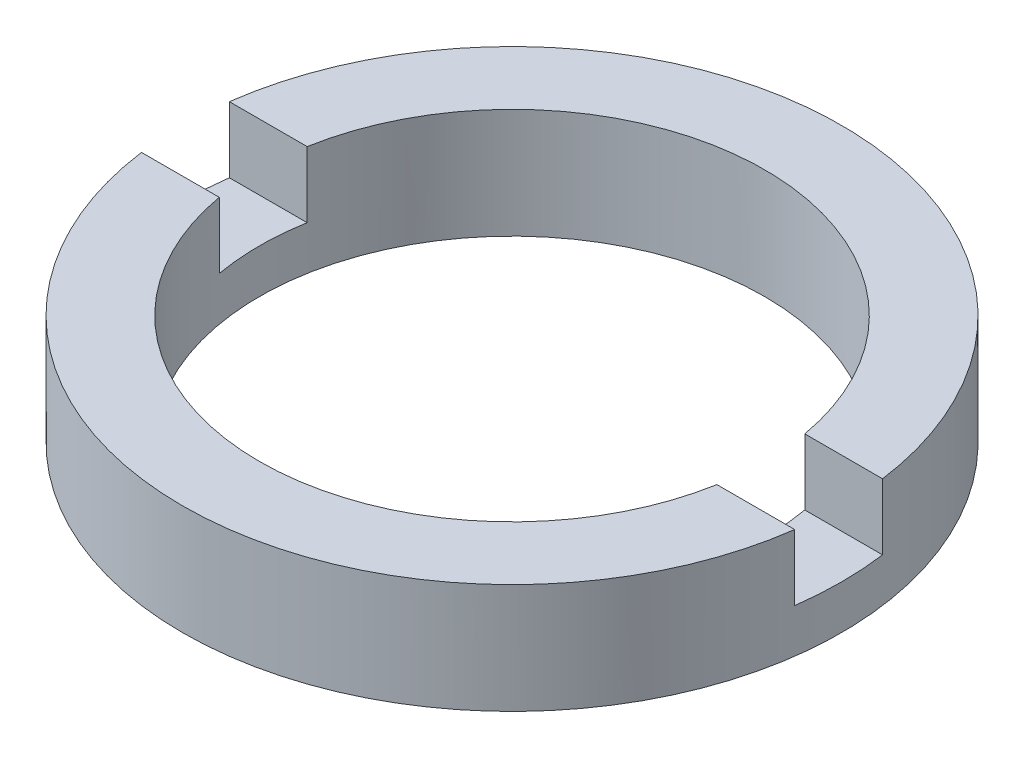
ISO-10303-21;
HEADER;
FILE_DESCRIPTION(('STEP AP214'),'2;1');
FILE_NAME('part.step','',(''),(''),'','','');
FILE_SCHEMA(('AUTOMOTIVE_DESIGN { 1 0 10303 214 1 1 1 1 }'));
ENDSEC;
DATA;
#1=APPLICATION_CONTEXT('core data for automotive mechanical design processes');
#2=APPLICATION_PROTOCOL_DEFINITION('international standard','automotive_design',2000,#1);
#3=PRODUCT_CONTEXT('',#1,'mechanical');
#4=PRODUCT('Part','Part','',(#3));
#5=PRODUCT_RELATED_PRODUCT_CATEGORY('part','',(#4));
#6=PRODUCT_DEFINITION_FORMATION('','',#4);
#7=PRODUCT_DEFINITION_CONTEXT('part definition',#1,'design');
#8=PRODUCT_DEFINITION('design','',#6,#7);
#9=PRODUCT_DEFINITION_SHAPE('','',#8);
#10=(LENGTH_UNIT() NAMED_UNIT(*) SI_UNIT(.MILLI.,.METRE.));
#11=(NAMED_UNIT(*) PLANE_ANGLE_UNIT() SI_UNIT($,.RADIAN.));
#12=(NAMED_UNIT(*) SI_UNIT($,.STERADIAN.) SOLID_ANGLE_UNIT());
#13=UNCERTAINTY_MEASURE_WITH_UNIT(LENGTH_MEASURE(1.E-05),#10,'distance_accuracy_value','');
#14=(GEOMETRIC_REPRESENTATION_CONTEXT(3) GLOBAL_UNCERTAINTY_ASSIGNED_CONTEXT((#13)) GLOBAL_UNIT_ASSIGNED_CONTEXT((#10,
#11,#12)) REPRESENTATION_CONTEXT('',''));
#15=CARTESIAN_POINT('',(0.,0.,0.));
#16=DIRECTION('',(0.,0.,1.));
#17=DIRECTION('',(1.,0.,0.));
#18=AXIS2_PLACEMENT_3D('',#15,#16,#17);
#19=CARTESIAN_POINT('',(5.75000000000001,-1.96424978717943,0.));
#20=DIRECTION('',(0.,-1.,0.));
#21=DIRECTION('',(0.,0.,-1.));
#22=AXIS2_PLACEMENT_3D('',#19,#20,#21);
#23=PLANE('',#22);
#24=CARTESIAN_POINT('',(0.,-1.96424978717943,0.));
#25=DIRECTION('',(0.,1.,0.));
#26=DIRECTION('',(0.,0.,1.));
#27=AXIS2_PLACEMENT_3D('',#24,#25,#26);
#28=CIRCLE('',#27,7.50000000000001);
#29=CARTESIAN_POINT('',(-7.43303437365927,-1.96424978717943,1.));
#30=VERTEX_POINT('',#29);
#31=CARTESIAN_POINT('',(7.43303437365925,-1.96424978717943,1.));
#32=VERTEX_POINT('',#31);
#33=EDGE_CURVE('E127',#30,#32,#28,.T.);
#34=ORIENTED_EDGE('',*,*,#33,.T.);
#35=DIRECTION('',(1.,0.,0.));
#36=VECTOR('',#35,1.);
#37=CARTESIAN_POINT('',(-26.8525402726146,-1.96424978717943,1.));
#38=LINE('',#37,#36);
#39=CARTESIAN_POINT('',(5.66237582645307,-1.96424978717943,1.));
#40=VERTEX_POINT('',#39);
#41=EDGE_CURVE('E120',#40,#32,#38,.T.);
#42=ORIENTED_EDGE('',*,*,#41,.F.);
#43=CARTESIAN_POINT('',(0.,-1.96424978717943,0.));
#44=DIRECTION('',(0.,1.,0.));
#45=DIRECTION('',(0.,0.,1.));
#46=AXIS2_PLACEMENT_3D('',#43,#44,#45);
#47=CIRCLE('',#46,5.75000000000001);
#48=CARTESIAN_POINT('',(-5.66237582645307,-1.96424978717943,1.));
#49=VERTEX_POINT('',#48);
#50=EDGE_CURVE('E134',#49,#40,#47,.T.);
#51=ORIENTED_EDGE('',*,*,#50,.F.);
#52=EDGE_CURVE('E149',#30,#49,#38,.T.);
#53=ORIENTED_EDGE('',*,*,#52,.F.);
#54=EDGE_LOOP('',(#34,#42,#51,#53));
#55=FACE_BOUND('',#54,.T.);
#56=ADVANCED_FACE('F37',(#55),#23,.F.);
#57=CARTESIAN_POINT('',(0.,56.2608426270136,0.));
#58=DIRECTION('',(0.,1.,0.));
#59=DIRECTION('',(0.,0.,1.));
#60=AXIS2_PLACEMENT_3D('',#57,#58,#59);
#61=CYLINDRICAL_SURFACE('',#60,7.50000000000001);
#62=CARTESIAN_POINT('',(0.,-3.46424978717943,0.));
#63=DIRECTION('',(0.,1.,0.));
#64=DIRECTION('',(0.,0.,1.));
#65=AXIS2_PLACEMENT_3D('',#62,#63,#64);
#66=CIRCLE('',#65,7.50000000000001);
#67=CARTESIAN_POINT('',(7.43303437365926,-3.46424978717943,1.));
#68=VERTEX_POINT('',#67);
#69=CARTESIAN_POINT('',(7.43303437365926,-3.46424978717943,-1.));
#70=VERTEX_POINT('',#69);
#71=EDGE_CURVE('E110',#68,#70,#66,.T.);
#72=ORIENTED_EDGE('',*,*,#71,.F.);
#73=DIRECTION('',(0.,1.,0.));
#74=VECTOR('',#73,1.);
#75=CARTESIAN_POINT('',(7.43303437365926,56.2608426270136,1.));
#76=LINE('',#75,#74);
#77=EDGE_CURVE('E162',#68,#32,#76,.T.);
#78=ORIENTED_EDGE('',*,*,#77,.T.);
#79=ORIENTED_EDGE('',*,*,#33,.F.);
#80=DIRECTION('',(0.,1.,0.));
#81=VECTOR('',#80,1.);
#82=CARTESIAN_POINT('',(-7.43303437365926,56.2608426270136,1.));
#83=LINE('',#82,#81);
#84=CARTESIAN_POINT('',(-7.43303437365926,-3.46424978717943,1.));
#85=VERTEX_POINT('',#84);
#86=EDGE_CURVE('E159',#30,#85,#83,.F.);
#87=ORIENTED_EDGE('',*,*,#86,.T.);
#88=CARTESIAN_POINT('',(-7.43303437365926,-3.46424978717943,-1.));
#89=VERTEX_POINT('',#88);
#90=EDGE_CURVE('E156',#89,#85,#66,.T.);
#91=ORIENTED_EDGE('',*,*,#90,.F.);
#92=DIRECTION('',(0.,1.,0.));
#93=VECTOR('',#92,1.);
#94=CARTESIAN_POINT('',(-7.43303437365926,56.2608426270136,-1.));
#95=LINE('',#94,#93);
#96=CARTESIAN_POINT('',(-7.43303437365927,-1.96424978717943,-1.));
#97=VERTEX_POINT('',#96);
#98=EDGE_CURVE('E109',#89,#97,#95,.T.);
#99=ORIENTED_EDGE('',*,*,#98,.T.);
#100=CARTESIAN_POINT('',(7.43303437365925,-1.96424978717943,-1.));
#101=VERTEX_POINT('',#100);
#102=EDGE_CURVE('E117',#101,#97,#28,.T.);
#103=ORIENTED_EDGE('',*,*,#102,.F.);
#104=DIRECTION('',(0.,1.,0.));
#105=VECTOR('',#104,1.);
#106=CARTESIAN_POINT('',(7.43303437365926,56.2608426270136,-1.));
#107=LINE('',#106,#105);
#108=EDGE_CURVE('E101',#101,#70,#107,.F.);
#109=ORIENTED_EDGE('',*,*,#108,.T.);
#110=EDGE_LOOP('',(#72,#78,#79,#87,#91,#99,#103,#109));
#111=FACE_BOUND('',#110,.T.);
#112=CARTESIAN_POINT('',(0.,-4.46424978717943,0.));
#113=DIRECTION('',(0.,1.,0.));
#114=DIRECTION('',(0.,0.,1.));
#115=AXIS2_PLACEMENT_3D('',#112,#113,#114);
#116=CIRCLE('',#115,7.50000000000001);
#117=CARTESIAN_POINT('',(0.,-4.46424978717943,7.50000000000001));
#118=VERTEX_POINT('',#117);
#119=EDGE_CURVE('E165',#118,#118,#116,.T.);
#120=ORIENTED_EDGE('',*,*,#119,.T.);
#121=EDGE_LOOP('',(#120));
#122=FACE_BOUND('',#121,.T.);
#123=ADVANCED_FACE('F39',(#111,#122),#61,.T.);
#124=ORIENTED_EDGE('',*,*,#102,.T.);
#125=DIRECTION('',(-1.,0.,0.));
#126=VECTOR('',#125,1.);
#127=CARTESIAN_POINT('',(-26.8525402726146,-1.96424978717943,-1.));
#128=LINE('',#127,#126);
#129=CARTESIAN_POINT('',(-5.66237582645307,-1.96424978717943,-1.));
#130=VERTEX_POINT('',#129);
#131=EDGE_CURVE('E121',#130,#97,#128,.T.);
#132=ORIENTED_EDGE('',*,*,#131,.F.);
#133=CARTESIAN_POINT('',(5.66237582645307,-1.96424978717943,-1.));
#134=VERTEX_POINT('',#133);
#135=EDGE_CURVE('E119',#134,#130,#47,.T.);
#136=ORIENTED_EDGE('',*,*,#135,.F.);
#137=EDGE_CURVE('E104',#101,#134,#128,.T.);
#138=ORIENTED_EDGE('',*,*,#137,.F.);
#139=EDGE_LOOP('',(#124,#132,#136,#138));
#140=FACE_BOUND('',#139,.T.);
#141=ADVANCED_FACE('F115',(#140),#23,.F.);
#142=CARTESIAN_POINT('',(0.,56.2608426270136,0.));
#143=DIRECTION('',(0.,1.,0.));
#144=DIRECTION('',(0.,0.,1.));
#145=AXIS2_PLACEMENT_3D('',#142,#143,#144);
#146=CYLINDRICAL_SURFACE('',#145,5.75000000000001);
#147=CARTESIAN_POINT('',(0.,-3.46424978717943,0.));
#148=DIRECTION('',(0.,1.,0.));
#149=DIRECTION('',(0.,0.,1.));
#150=AXIS2_PLACEMENT_3D('',#147,#148,#149);
#151=CIRCLE('',#150,5.75000000000001);
#152=CARTESIAN_POINT('',(-5.66237582645307,-3.46424978717943,1.));
#153=VERTEX_POINT('',#152);
#154=CARTESIAN_POINT('',(-5.66237582645307,-3.46424978717943,-1.));
#155=VERTEX_POINT('',#154);
#156=EDGE_CURVE('E131',#153,#155,#151,.F.);
#157=ORIENTED_EDGE('',*,*,#156,.F.);
#158=DIRECTION('',(0.,1.,0.));
#159=VECTOR('',#158,1.);
#160=CARTESIAN_POINT('',(-5.66237582645307,56.2608426270136,1.));
#161=LINE('',#160,#159);
#162=EDGE_CURVE('E11',#153,#49,#161,.T.);
#163=ORIENTED_EDGE('',*,*,#162,.T.);
#164=ORIENTED_EDGE('',*,*,#50,.T.);
#165=DIRECTION('',(0.,1.,0.));
#166=VECTOR('',#165,1.);
#167=CARTESIAN_POINT('',(5.66237582645307,56.2608426270136,1.));
#168=LINE('',#167,#166);
#169=CARTESIAN_POINT('',(5.66237582645307,-3.46424978717943,1.));
#170=VERTEX_POINT('',#169);
#171=EDGE_CURVE('E138',#40,#170,#168,.F.);
#172=ORIENTED_EDGE('',*,*,#171,.T.);
#173=CARTESIAN_POINT('',(5.66237582645307,-3.46424978717943,-1.));
#174=VERTEX_POINT('',#173);
#175=EDGE_CURVE('E126',#174,#170,#151,.F.);
#176=ORIENTED_EDGE('',*,*,#175,.F.);
#177=DIRECTION('',(0.,1.,0.));
#178=VECTOR('',#177,1.);
#179=CARTESIAN_POINT('',(5.66237582645307,56.2608426270136,-1.));
#180=LINE('',#179,#178);
#181=EDGE_CURVE('E129',#174,#134,#180,.T.);
#182=ORIENTED_EDGE('',*,*,#181,.T.);
#183=ORIENTED_EDGE('',*,*,#135,.T.);
#184=DIRECTION('',(0.,1.,0.));
#185=VECTOR('',#184,1.);
#186=CARTESIAN_POINT('',(-5.66237582645307,56.2608426270136,-1.));
#187=LINE('',#186,#185);
#188=EDGE_CURVE('E45',#130,#155,#187,.F.);
#189=ORIENTED_EDGE('',*,*,#188,.T.);
#190=EDGE_LOOP('',(#157,#163,#164,#172,#176,#182,#183,#189));
#191=FACE_BOUND('',#190,.T.);
#192=CARTESIAN_POINT('',(0.,-4.46424978717943,0.));
#193=DIRECTION('',(0.,1.,0.));
#194=DIRECTION('',(0.,0.,1.));
#195=AXIS2_PLACEMENT_3D('',#192,#193,#194);
#196=CIRCLE('',#195,5.75000000000001);
#197=CARTESIAN_POINT('',(0.,-4.46424978717943,5.75000000000001));
#198=VERTEX_POINT('',#197);
#199=EDGE_CURVE('E167',#198,#198,#196,.T.);
#200=ORIENTED_EDGE('',*,*,#199,.F.);
#201=EDGE_LOOP('',(#200));
#202=FACE_BOUND('',#201,.T.);
#203=ADVANCED_FACE('F173',(#191,#202),#146,.F.);
#204=CARTESIAN_POINT('',(5.75000000000001,-4.46424978717943,0.));
#205=DIRECTION('',(0.,1.,0.));
#206=DIRECTION('',(0.,0.,1.));
#207=AXIS2_PLACEMENT_3D('',#204,#205,#206);
#208=PLANE('',#207);
#209=ORIENTED_EDGE('',*,*,#119,.F.);
#210=EDGE_LOOP('',(#209));
#211=FACE_BOUND('',#210,.T.);
#212=ORIENTED_EDGE('',*,*,#199,.T.);
#213=EDGE_LOOP('',(#212));
#214=FACE_BOUND('',#213,.T.);
#215=ADVANCED_FACE('F203',(#211,#214),#208,.F.);
#216=CARTESIAN_POINT('',(0.,-3.46424978717943,0.));
#217=DIRECTION('',(0.,1.,0.));
#218=DIRECTION('',(0.,0.,1.));
#219=AXIS2_PLACEMENT_3D('',#216,#217,#218);
#220=PLANE('',#219);
#221=ORIENTED_EDGE('',*,*,#71,.T.);
#222=DIRECTION('',(-1.,0.,0.));
#223=VECTOR('',#222,1.);
#224=CARTESIAN_POINT('',(-26.8525402726146,-3.46424978717943,-1.));
#225=LINE('',#224,#223);
#226=EDGE_CURVE('E60',#70,#174,#225,.T.);
#227=ORIENTED_EDGE('',*,*,#226,.T.);
#228=ORIENTED_EDGE('',*,*,#175,.T.);
#229=DIRECTION('',(1.,0.,0.));
#230=VECTOR('',#229,1.);
#231=CARTESIAN_POINT('',(-26.8525402726146,-3.46424978717943,1.));
#232=LINE('',#231,#230);
#233=EDGE_CURVE('E151',#170,#68,#232,.T.);
#234=ORIENTED_EDGE('',*,*,#233,.T.);
#235=EDGE_LOOP('',(#221,#227,#228,#234));
#236=FACE_BOUND('',#235,.T.);
#237=ADVANCED_FACE('F177',(#236),#220,.T.);
#238=CARTESIAN_POINT('',(-26.8525402726146,-3.46424978717943,-1.));
#239=DIRECTION('',(0.,0.,-1.));
#240=DIRECTION('',(-1.,0.,0.));
#241=AXIS2_PLACEMENT_3D('',#238,#239,#240);
#242=PLANE('',#241);
#243=ORIENTED_EDGE('',*,*,#137,.T.);
#244=ORIENTED_EDGE('',*,*,#181,.F.);
#245=ORIENTED_EDGE('',*,*,#226,.F.);
#246=ORIENTED_EDGE('',*,*,#108,.F.);
#247=EDGE_LOOP('',(#243,#244,#245,#246));
#248=FACE_BOUND('',#247,.T.);
#249=ADVANCED_FACE('F103',(#248),#242,.F.);
#250=CARTESIAN_POINT('',(-26.8525402726146,-3.46424978717943,1.));
#251=DIRECTION('',(0.,0.,1.));
#252=DIRECTION('',(1.,0.,0.));
#253=AXIS2_PLACEMENT_3D('',#250,#251,#252);
#254=PLANE('',#253);
#255=ORIENTED_EDGE('',*,*,#233,.F.);
#256=ORIENTED_EDGE('',*,*,#171,.F.);
#257=ORIENTED_EDGE('',*,*,#41,.T.);
#258=ORIENTED_EDGE('',*,*,#77,.F.);
#259=EDGE_LOOP('',(#255,#256,#257,#258));
#260=FACE_BOUND('',#259,.T.);
#261=ADVANCED_FACE('F179',(#260),#254,.F.);
#262=ORIENTED_EDGE('',*,*,#52,.T.);
#263=ORIENTED_EDGE('',*,*,#162,.F.);
#264=EDGE_CURVE('E52',#85,#153,#232,.T.);
#265=ORIENTED_EDGE('',*,*,#264,.F.);
#266=ORIENTED_EDGE('',*,*,#86,.F.);
#267=EDGE_LOOP('',(#262,#263,#265,#266));
#268=FACE_BOUND('',#267,.T.);
#269=ADVANCED_FACE('F185',(#268),#254,.F.);
#270=EDGE_CURVE('E146',#155,#89,#225,.T.);
#271=ORIENTED_EDGE('',*,*,#270,.F.);
#272=ORIENTED_EDGE('',*,*,#188,.F.);
#273=ORIENTED_EDGE('',*,*,#131,.T.);
#274=ORIENTED_EDGE('',*,*,#98,.F.);
#275=EDGE_LOOP('',(#271,#272,#273,#274));
#276=FACE_BOUND('',#275,.T.);
#277=ADVANCED_FACE('F148',(#276),#242,.F.);
#278=ORIENTED_EDGE('',*,*,#90,.T.);
#279=ORIENTED_EDGE('',*,*,#264,.T.);
#280=ORIENTED_EDGE('',*,*,#156,.T.);
#281=ORIENTED_EDGE('',*,*,#270,.T.);
#282=EDGE_LOOP('',(#278,#279,#280,#281));
#283=FACE_BOUND('',#282,.T.);
#284=ADVANCED_FACE('F145',(#283),#220,.T.);
#285=CLOSED_SHELL('',(#56,#123,#141,#203,#215,#237,#249,#261,#269,#277,#284));
#286=MANIFOLD_SOLID_BREP('B2',#285);
#287=ADVANCED_BREP_SHAPE_REPRESENTATION('',(#18,#286),#14);
#288=SHAPE_DEFINITION_REPRESENTATION(#9,#287);
ENDSEC;
END-ISO-10303-21;
